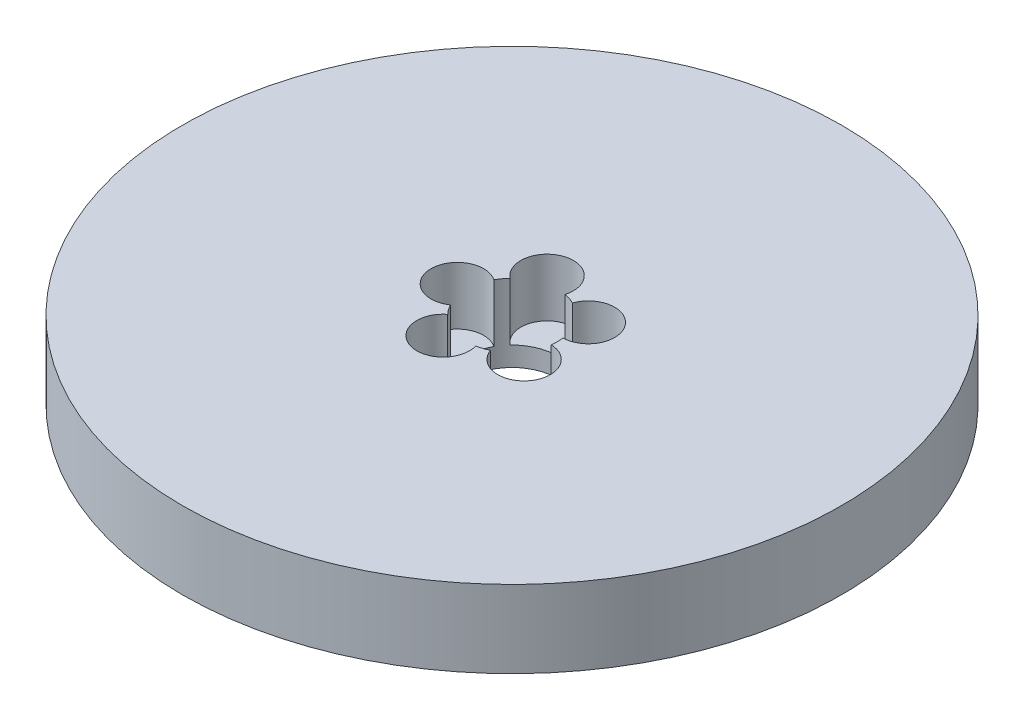
ISO-10303-21;
HEADER;
FILE_DESCRIPTION(('STEP AP214'),'2;1');
FILE_NAME('part.step','',(''),(''),'','','');
FILE_SCHEMA(('AUTOMOTIVE_DESIGN { 1 0 10303 214 1 1 1 1 }'));
ENDSEC;
DATA;
#1=APPLICATION_CONTEXT('core data for automotive mechanical design processes');
#2=APPLICATION_PROTOCOL_DEFINITION('international standard','automotive_design',2000,#1);
#3=PRODUCT_CONTEXT('',#1,'mechanical');
#4=PRODUCT('Part','Part','',(#3));
#5=PRODUCT_RELATED_PRODUCT_CATEGORY('part','',(#4));
#6=PRODUCT_DEFINITION_FORMATION('','',#4);
#7=PRODUCT_DEFINITION_CONTEXT('part definition',#1,'design');
#8=PRODUCT_DEFINITION('design','',#6,#7);
#9=PRODUCT_DEFINITION_SHAPE('','',#8);
#10=(LENGTH_UNIT() NAMED_UNIT(*) SI_UNIT(.MILLI.,.METRE.));
#11=(NAMED_UNIT(*) PLANE_ANGLE_UNIT() SI_UNIT($,.RADIAN.));
#12=(NAMED_UNIT(*) SI_UNIT($,.STERADIAN.) SOLID_ANGLE_UNIT());
#13=UNCERTAINTY_MEASURE_WITH_UNIT(LENGTH_MEASURE(1.E-05),#10,'distance_accuracy_value','');
#14=(GEOMETRIC_REPRESENTATION_CONTEXT(3) GLOBAL_UNCERTAINTY_ASSIGNED_CONTEXT((#13)) GLOBAL_UNIT_ASSIGNED_CONTEXT((#10,
#11,#12)) REPRESENTATION_CONTEXT('',''));
#15=CARTESIAN_POINT('',(0.,0.,0.));
#16=DIRECTION('',(0.,0.,1.));
#17=DIRECTION('',(1.,0.,0.));
#18=AXIS2_PLACEMENT_3D('',#15,#16,#17);
#19=CARTESIAN_POINT('',(0.,17.,0.));
#20=DIRECTION('',(0.,-1.,0.));
#21=DIRECTION('',(0.,0.,-1.));
#22=AXIS2_PLACEMENT_3D('',#19,#20,#21);
#23=CYLINDRICAL_SURFACE('',#22,72.5);
#24=CARTESIAN_POINT('',(0.,17.,0.));
#25=DIRECTION('',(0.,1.,0.));
#26=DIRECTION('',(0.,0.,1.));
#27=AXIS2_PLACEMENT_3D('',#24,#25,#26);
#28=CIRCLE('',#27,72.5);
#29=CARTESIAN_POINT('',(0.,17.,72.5));
#30=VERTEX_POINT('',#29);
#31=EDGE_CURVE('E157',#30,#30,#28,.T.);
#32=ORIENTED_EDGE('',*,*,#31,.F.);
#33=EDGE_LOOP('',(#32));
#34=FACE_BOUND('',#33,.T.);
#35=CARTESIAN_POINT('',(0.,0.,0.));
#36=DIRECTION('',(0.,1.,0.));
#37=DIRECTION('',(0.,0.,1.));
#38=AXIS2_PLACEMENT_3D('',#35,#36,#37);
#39=CIRCLE('',#38,72.5);
#40=CARTESIAN_POINT('',(0.,0.,72.5));
#41=VERTEX_POINT('',#40);
#42=EDGE_CURVE('E150',#41,#41,#39,.T.);
#43=ORIENTED_EDGE('',*,*,#42,.T.);
#44=EDGE_LOOP('',(#43));
#45=FACE_BOUND('',#44,.T.);
#46=ADVANCED_FACE('F39',(#34,#45),#23,.T.);
#47=CARTESIAN_POINT('',(0.,17.,0.));
#48=DIRECTION('',(0.,1.,0.));
#49=DIRECTION('',(0.,0.,1.));
#50=AXIS2_PLACEMENT_3D('',#47,#48,#49);
#51=PLANE('',#50);
#52=CARTESIAN_POINT('',(-3.71574455172033,17.,-11.4358858351779));
#53=DIRECTION('',(0.,1.,0.));
#54=DIRECTION('',(-0.95105651629515,0.,0.309016994374958));
#55=AXIS2_PLACEMENT_3D('',#52,#53,#54);
#56=CIRCLE('',#55,5.78738349400085);
#57=CARTESIAN_POINT('',(1.84394883160901,17.,-9.82852240707665));
#58=VERTEX_POINT('',#57);
#59=CARTESIAN_POINT('',(-7.26884646423545,17.,-6.86759572771809));
#60=VERTEX_POINT('',#59);
#61=EDGE_CURVE('E194',#58,#60,#56,.T.);
#62=ORIENTED_EDGE('',*,*,#61,.F.);
#63=CARTESIAN_POINT('',(0.,17.,0.));
#64=DIRECTION('',(0.,1.,0.));
#65=DIRECTION('',(0.,0.,1.));
#66=AXIS2_PLACEMENT_3D('',#63,#64,#65);
#67=CIRCLE('',#66,10.);
#68=CARTESIAN_POINT('',(4.28527458117607,17.,-9.03528758612178));
#69=VERTEX_POINT('',#68);
#70=EDGE_CURVE('E147',#69,#58,#67,.T.);
#71=ORIENTED_EDGE('',*,*,#70,.F.);
#72=CARTESIAN_POINT('',(9.72794552991567,17.,-7.06776613760351));
#73=DIRECTION('',(0.,1.,0.));
#74=DIRECTION('',(-0.58778525229248,0.,-0.809016994374942));
#75=AXIS2_PLACEMENT_3D('',#72,#73,#74);
#76=CIRCLE('',#75,5.78738349400085);
#77=CARTESIAN_POINT('',(9.91729180652819,17.,-1.28348090136504));
#78=VERTEX_POINT('',#77);
#79=EDGE_CURVE('E254',#78,#69,#76,.T.);
#80=ORIENTED_EDGE('',*,*,#79,.F.);
#81=CARTESIAN_POINT('',(9.91729180652821,17.,1.28348090136489));
#82=VERTEX_POINT('',#81);
#83=EDGE_CURVE('E144',#82,#78,#67,.T.);
#84=ORIENTED_EDGE('',*,*,#83,.F.);
#85=CARTESIAN_POINT('',(9.72794552991578,17.,7.06776613760337));
#86=DIRECTION('',(0.,1.,0.));
#87=DIRECTION('',(0.587785252292469,0.,-0.809016994374951));
#88=AXIS2_PLACEMENT_3D('',#85,#86,#87);
#89=CIRCLE('',#88,5.78738349400085);
#90=CARTESIAN_POINT('',(4.2852745811762,17.,9.03528758612171));
#91=VERTEX_POINT('',#90);
#92=EDGE_CURVE('E141',#91,#82,#89,.T.);
#93=ORIENTED_EDGE('',*,*,#92,.F.);
#94=CARTESIAN_POINT('',(1.84394883160915,17.,9.82852240707662));
#95=VERTEX_POINT('',#94);
#96=EDGE_CURVE('E134',#95,#91,#67,.T.);
#97=ORIENTED_EDGE('',*,*,#96,.F.);
#98=CARTESIAN_POINT('',(-3.71574455172017,17.,11.4358858351779));
#99=DIRECTION('',(0.,1.,0.));
#100=DIRECTION('',(0.951056516295155,0.,0.309016994374945));
#101=AXIS2_PLACEMENT_3D('',#98,#99,#100);
#102=CIRCLE('',#101,5.78738349400085);
#103=CARTESIAN_POINT('',(-7.26884646423535,17.,6.8675957277182));
#104=VERTEX_POINT('',#103);
#105=EDGE_CURVE('E111',#104,#95,#102,.T.);
#106=ORIENTED_EDGE('',*,*,#105,.F.);
#107=CARTESIAN_POINT('',(-8.77766875507811,17.,4.79088000539834));
#108=VERTEX_POINT('',#107);
#109=EDGE_CURVE('E145',#108,#104,#67,.T.);
#110=ORIENTED_EDGE('',*,*,#109,.F.);
#111=CARTESIAN_POINT('',(-12.0244019563911,17.,0.));
#112=DIRECTION('',(0.,1.,0.));
#113=DIRECTION('',(0.,0.,1.));
#114=AXIS2_PLACEMENT_3D('',#111,#112,#113);
#115=CIRCLE('',#114,5.78738349400085);
#116=CARTESIAN_POINT('',(-8.77766875507811,17.,-4.79088000539834));
#117=VERTEX_POINT('',#116);
#118=EDGE_CURVE('E153',#117,#108,#115,.T.);
#119=ORIENTED_EDGE('',*,*,#118,.F.);
#120=EDGE_CURVE('E146',#60,#117,#67,.T.);
#121=ORIENTED_EDGE('',*,*,#120,.F.);
#122=EDGE_LOOP('',(#62,#71,#80,#84,#93,#97,#106,#110,#119,#121));
#123=FACE_BOUND('',#122,.T.);
#124=ORIENTED_EDGE('',*,*,#31,.T.);
#125=EDGE_LOOP('',(#124));
#126=FACE_BOUND('',#125,.T.);
#127=ADVANCED_FACE('F139',(#123,#126),#51,.T.);
#128=CARTESIAN_POINT('',(0.,0.,0.));
#129=DIRECTION('',(0.,1.,0.));
#130=DIRECTION('',(0.,0.,1.));
#131=AXIS2_PLACEMENT_3D('',#128,#129,#130);
#132=PLANE('',#131);
#133=CARTESIAN_POINT('',(0.,0.,0.));
#134=DIRECTION('',(0.,1.,0.));
#135=DIRECTION('',(0.,0.,1.));
#136=AXIS2_PLACEMENT_3D('',#133,#134,#135);
#137=CIRCLE('',#136,10.);
#138=CARTESIAN_POINT('',(0.,0.,10.));
#139=VERTEX_POINT('',#138);
#140=EDGE_CURVE('E154',#139,#139,#137,.T.);
#141=ORIENTED_EDGE('',*,*,#140,.T.);
#142=EDGE_LOOP('',(#141));
#143=FACE_BOUND('',#142,.T.);
#144=ORIENTED_EDGE('',*,*,#42,.F.);
#145=EDGE_LOOP('',(#144));
#146=FACE_BOUND('',#145,.T.);
#147=ADVANCED_FACE('F213',(#143,#146),#132,.F.);
#148=CARTESIAN_POINT('',(0.,17.,0.));
#149=DIRECTION('',(0.,-1.,0.));
#150=DIRECTION('',(0.,0.,-1.));
#151=AXIS2_PLACEMENT_3D('',#148,#149,#150);
#152=CYLINDRICAL_SURFACE('',#151,10.);
#153=DIRECTION('',(0.,1.,0.));
#154=VECTOR('',#153,1.);
#155=CARTESIAN_POINT('',(1.84394883160901,10.6433004450835,-9.82852240707665));
#156=LINE('',#155,#154);
#157=CARTESIAN_POINT('',(1.84394883160901,4.28660089016696,-9.82852240707665));
#158=VERTEX_POINT('',#157);
#159=EDGE_CURVE('E11',#158,#58,#156,.T.);
#160=ORIENTED_EDGE('',*,*,#159,.F.);
#161=CARTESIAN_POINT('',(0.,4.28660089016696,0.));
#162=DIRECTION('',(0.,1.,0.));
#163=DIRECTION('',(0.,0.,1.));
#164=AXIS2_PLACEMENT_3D('',#161,#162,#163);
#165=CIRCLE('',#164,10.);
#166=CARTESIAN_POINT('',(-7.26884646423545,4.28660089016696,-6.86759572771809));
#167=VERTEX_POINT('',#166);
#168=EDGE_CURVE('E189',#158,#167,#165,.T.);
#169=ORIENTED_EDGE('',*,*,#168,.T.);
#170=DIRECTION('',(0.,1.,0.));
#171=VECTOR('',#170,1.);
#172=CARTESIAN_POINT('',(-7.26884646423545,10.6433004450835,-6.86759572771809));
#173=LINE('',#172,#171);
#174=EDGE_CURVE('E46',#60,#167,#173,.F.);
#175=ORIENTED_EDGE('',*,*,#174,.F.);
#176=ORIENTED_EDGE('',*,*,#120,.T.);
#177=DIRECTION('',(0.,1.,0.));
#178=VECTOR('',#177,1.);
#179=CARTESIAN_POINT('',(-8.77766875507811,10.6433004450835,-4.79088000539834));
#180=LINE('',#179,#178);
#181=CARTESIAN_POINT('',(-8.77766875507811,4.28660089016696,-4.79088000539834));
#182=VERTEX_POINT('',#181);
#183=EDGE_CURVE('E168',#182,#117,#180,.T.);
#184=ORIENTED_EDGE('',*,*,#183,.F.);
#185=CARTESIAN_POINT('',(0.,4.28660089016696,0.));
#186=DIRECTION('',(0.,1.,0.));
#187=DIRECTION('',(0.,0.,1.));
#188=AXIS2_PLACEMENT_3D('',#185,#186,#187);
#189=CIRCLE('',#188,10.);
#190=CARTESIAN_POINT('',(-8.77766875507811,4.28660089016696,4.79088000539834));
#191=VERTEX_POINT('',#190);
#192=EDGE_CURVE('E165',#182,#191,#189,.T.);
#193=ORIENTED_EDGE('',*,*,#192,.T.);
#194=DIRECTION('',(0.,1.,0.));
#195=VECTOR('',#194,1.);
#196=CARTESIAN_POINT('',(-8.77766875507811,10.6433004450835,4.79088000539834));
#197=LINE('',#196,#195);
#198=EDGE_CURVE('E170',#108,#191,#197,.F.);
#199=ORIENTED_EDGE('',*,*,#198,.F.);
#200=ORIENTED_EDGE('',*,*,#109,.T.);
#201=DIRECTION('',(0.,1.,0.));
#202=VECTOR('',#201,1.);
#203=CARTESIAN_POINT('',(-7.26884646423535,10.6433004450835,6.8675957277182));
#204=LINE('',#203,#202);
#205=CARTESIAN_POINT('',(-7.26884646423535,4.28660089016696,6.8675957277182));
#206=VERTEX_POINT('',#205);
#207=EDGE_CURVE('E121',#206,#104,#204,.T.);
#208=ORIENTED_EDGE('',*,*,#207,.F.);
#209=CARTESIAN_POINT('',(0.,4.28660089016696,0.));
#210=DIRECTION('',(0.,1.,0.));
#211=DIRECTION('',(0.,0.,1.));
#212=AXIS2_PLACEMENT_3D('',#209,#210,#211);
#213=CIRCLE('',#212,10.);
#214=CARTESIAN_POINT('',(1.84394883160915,4.28660089016696,9.82852240707662));
#215=VERTEX_POINT('',#214);
#216=EDGE_CURVE('E136',#206,#215,#213,.T.);
#217=ORIENTED_EDGE('',*,*,#216,.T.);
#218=DIRECTION('',(0.,1.,0.));
#219=VECTOR('',#218,1.);
#220=CARTESIAN_POINT('',(1.84394883160915,10.6433004450835,9.82852240707662));
#221=LINE('',#220,#219);
#222=EDGE_CURVE('E117',#95,#215,#221,.F.);
#223=ORIENTED_EDGE('',*,*,#222,.F.);
#224=ORIENTED_EDGE('',*,*,#96,.T.);
#225=DIRECTION('',(0.,1.,0.));
#226=VECTOR('',#225,1.);
#227=CARTESIAN_POINT('',(4.2852745811762,10.6433004450835,9.03528758612171));
#228=LINE('',#227,#226);
#229=CARTESIAN_POINT('',(4.2852745811762,4.28660089016696,9.03528758612171));
#230=VERTEX_POINT('',#229);
#231=EDGE_CURVE('E182',#230,#91,#228,.T.);
#232=ORIENTED_EDGE('',*,*,#231,.F.);
#233=CARTESIAN_POINT('',(0.,4.28660089016696,0.));
#234=DIRECTION('',(0.,1.,0.));
#235=DIRECTION('',(0.,0.,1.));
#236=AXIS2_PLACEMENT_3D('',#233,#234,#235);
#237=CIRCLE('',#236,10.);
#238=CARTESIAN_POINT('',(9.91729180652821,4.28660089016696,1.28348090136489));
#239=VERTEX_POINT('',#238);
#240=EDGE_CURVE('E174',#230,#239,#237,.T.);
#241=ORIENTED_EDGE('',*,*,#240,.T.);
#242=DIRECTION('',(0.,1.,0.));
#243=VECTOR('',#242,1.);
#244=CARTESIAN_POINT('',(9.91729180652821,10.6433004450835,1.28348090136489));
#245=LINE('',#244,#243);
#246=EDGE_CURVE('E177',#82,#239,#245,.F.);
#247=ORIENTED_EDGE('',*,*,#246,.F.);
#248=ORIENTED_EDGE('',*,*,#83,.T.);
#249=DIRECTION('',(0.,1.,0.));
#250=VECTOR('',#249,1.);
#251=CARTESIAN_POINT('',(9.91729180652819,10.6433004450835,-1.28348090136504));
#252=LINE('',#251,#250);
#253=CARTESIAN_POINT('',(9.91729180652819,4.28660089016696,-1.28348090136504));
#254=VERTEX_POINT('',#253);
#255=EDGE_CURVE('E187',#254,#78,#252,.T.);
#256=ORIENTED_EDGE('',*,*,#255,.F.);
#257=CARTESIAN_POINT('',(0.,4.28660089016696,0.));
#258=DIRECTION('',(0.,1.,0.));
#259=DIRECTION('',(0.,0.,1.));
#260=AXIS2_PLACEMENT_3D('',#257,#258,#259);
#261=CIRCLE('',#260,10.);
#262=CARTESIAN_POINT('',(4.28527458117607,4.28660089016696,-9.03528758612178));
#263=VERTEX_POINT('',#262);
#264=EDGE_CURVE('E181',#254,#263,#261,.T.);
#265=ORIENTED_EDGE('',*,*,#264,.T.);
#266=DIRECTION('',(0.,1.,0.));
#267=VECTOR('',#266,1.);
#268=CARTESIAN_POINT('',(4.28527458117607,10.6433004450835,-9.03528758612178));
#269=LINE('',#268,#267);
#270=EDGE_CURVE('E186',#69,#263,#269,.F.);
#271=ORIENTED_EDGE('',*,*,#270,.F.);
#272=ORIENTED_EDGE('',*,*,#70,.T.);
#273=EDGE_LOOP('',(#160,#169,#175,#176,#184,#193,#199,#200,#208,#217,#223,#224,#232,#241,#247,
#248,#256,#265,#271,#272));
#274=FACE_BOUND('',#273,.T.);
#275=ORIENTED_EDGE('',*,*,#140,.F.);
#276=EDGE_LOOP('',(#275));
#277=FACE_BOUND('',#276,.T.);
#278=ADVANCED_FACE('F135',(#274,#277),#152,.F.);
#279=CARTESIAN_POINT('',(-12.0244019563911,4.28660089016696,0.));
#280=DIRECTION('',(0.,1.,0.));
#281=DIRECTION('',(0.,0.,1.));
#282=AXIS2_PLACEMENT_3D('',#279,#280,#281);
#283=CYLINDRICAL_SURFACE('',#282,5.78738349400085);
#284=ORIENTED_EDGE('',*,*,#183,.T.);
#285=ORIENTED_EDGE('',*,*,#118,.T.);
#286=ORIENTED_EDGE('',*,*,#198,.T.);
#287=CARTESIAN_POINT('',(-12.0244019563911,4.28660089016696,0.));
#288=DIRECTION('',(0.,1.,0.));
#289=DIRECTION('',(0.,0.,1.));
#290=AXIS2_PLACEMENT_3D('',#287,#288,#289);
#291=CIRCLE('',#290,5.78738349400085);
#292=EDGE_CURVE('E158',#182,#191,#291,.T.);
#293=ORIENTED_EDGE('',*,*,#292,.F.);
#294=EDGE_LOOP('',(#284,#285,#286,#293));
#295=FACE_BOUND('',#294,.T.);
#296=ADVANCED_FACE('F221',(#295),#283,.F.);
#297=CARTESIAN_POINT('',(-12.0244019563911,4.28660089016696,0.));
#298=DIRECTION('',(0.,1.,0.));
#299=DIRECTION('',(0.,0.,1.));
#300=AXIS2_PLACEMENT_3D('',#297,#298,#299);
#301=PLANE('',#300);
#302=ORIENTED_EDGE('',*,*,#292,.T.);
#303=ORIENTED_EDGE('',*,*,#192,.F.);
#304=EDGE_LOOP('',(#302,#303));
#305=FACE_BOUND('',#304,.T.);
#306=ADVANCED_FACE('F227',(#305),#301,.T.);
#307=CARTESIAN_POINT('',(-3.71574455172017,4.28660089016696,11.4358858351779));
#308=DIRECTION('',(0.,1.,0.));
#309=DIRECTION('',(0.,0.,1.));
#310=AXIS2_PLACEMENT_3D('',#307,#308,#309);
#311=CYLINDRICAL_SURFACE('',#310,5.78738349400085);
#312=ORIENTED_EDGE('',*,*,#207,.T.);
#313=ORIENTED_EDGE('',*,*,#105,.T.);
#314=ORIENTED_EDGE('',*,*,#222,.T.);
#315=CARTESIAN_POINT('',(-3.71574455172017,4.28660089016696,11.4358858351779));
#316=DIRECTION('',(0.,1.,0.));
#317=DIRECTION('',(0.951056516295155,0.,0.309016994374945));
#318=AXIS2_PLACEMENT_3D('',#315,#316,#317);
#319=CIRCLE('',#318,5.78738349400085);
#320=EDGE_CURVE('E127',#206,#215,#319,.T.);
#321=ORIENTED_EDGE('',*,*,#320,.F.);
#322=EDGE_LOOP('',(#312,#313,#314,#321));
#323=FACE_BOUND('',#322,.T.);
#324=ADVANCED_FACE('F116',(#323),#311,.F.);
#325=CARTESIAN_POINT('',(-3.71574455172017,4.28660089016696,11.4358858351779));
#326=DIRECTION('',(0.,1.,0.));
#327=DIRECTION('',(0.951056516295155,0.,0.309016994374945));
#328=AXIS2_PLACEMENT_3D('',#325,#326,#327);
#329=PLANE('',#328);
#330=ORIENTED_EDGE('',*,*,#320,.T.);
#331=ORIENTED_EDGE('',*,*,#216,.F.);
#332=EDGE_LOOP('',(#330,#331));
#333=FACE_BOUND('',#332,.T.);
#334=ADVANCED_FACE('F234',(#333),#329,.T.);
#335=CARTESIAN_POINT('',(9.72794552991578,4.28660089016696,7.06776613760337));
#336=DIRECTION('',(0.,1.,0.));
#337=DIRECTION('',(0.,0.,1.));
#338=AXIS2_PLACEMENT_3D('',#335,#336,#337);
#339=CYLINDRICAL_SURFACE('',#338,5.78738349400085);
#340=ORIENTED_EDGE('',*,*,#231,.T.);
#341=ORIENTED_EDGE('',*,*,#92,.T.);
#342=ORIENTED_EDGE('',*,*,#246,.T.);
#343=CARTESIAN_POINT('',(9.72794552991578,4.28660089016696,7.06776613760337));
#344=DIRECTION('',(0.,1.,0.));
#345=DIRECTION('',(0.587785252292469,0.,-0.809016994374951));
#346=AXIS2_PLACEMENT_3D('',#343,#344,#345);
#347=CIRCLE('',#346,5.78738349400085);
#348=EDGE_CURVE('E130',#230,#239,#347,.T.);
#349=ORIENTED_EDGE('',*,*,#348,.F.);
#350=EDGE_LOOP('',(#340,#341,#342,#349));
#351=FACE_BOUND('',#350,.T.);
#352=ADVANCED_FACE('F240',(#351),#339,.F.);
#353=CARTESIAN_POINT('',(9.72794552991578,4.28660089016696,7.06776613760337));
#354=DIRECTION('',(0.,1.,0.));
#355=DIRECTION('',(0.587785252292469,0.,-0.809016994374951));
#356=AXIS2_PLACEMENT_3D('',#353,#354,#355);
#357=PLANE('',#356);
#358=ORIENTED_EDGE('',*,*,#348,.T.);
#359=ORIENTED_EDGE('',*,*,#240,.F.);
#360=EDGE_LOOP('',(#358,#359));
#361=FACE_BOUND('',#360,.T.);
#362=ADVANCED_FACE('F245',(#361),#357,.T.);
#363=CARTESIAN_POINT('',(9.72794552991567,4.28660089016696,-7.06776613760351));
#364=DIRECTION('',(0.,1.,0.));
#365=DIRECTION('',(0.,0.,1.));
#366=AXIS2_PLACEMENT_3D('',#363,#364,#365);
#367=CYLINDRICAL_SURFACE('',#366,5.78738349400085);
#368=ORIENTED_EDGE('',*,*,#255,.T.);
#369=ORIENTED_EDGE('',*,*,#79,.T.);
#370=ORIENTED_EDGE('',*,*,#270,.T.);
#371=CARTESIAN_POINT('',(9.72794552991567,4.28660089016696,-7.06776613760351));
#372=DIRECTION('',(0.,1.,0.));
#373=DIRECTION('',(-0.58778525229248,0.,-0.809016994374942));
#374=AXIS2_PLACEMENT_3D('',#371,#372,#373);
#375=CIRCLE('',#374,5.78738349400085);
#376=EDGE_CURVE('E56',#254,#263,#375,.T.);
#377=ORIENTED_EDGE('',*,*,#376,.F.);
#378=EDGE_LOOP('',(#368,#369,#370,#377));
#379=FACE_BOUND('',#378,.T.);
#380=ADVANCED_FACE('F266',(#379),#367,.F.);
#381=CARTESIAN_POINT('',(9.72794552991567,4.28660089016696,-7.06776613760351));
#382=DIRECTION('',(0.,1.,0.));
#383=DIRECTION('',(-0.58778525229248,0.,-0.809016994374942));
#384=AXIS2_PLACEMENT_3D('',#381,#382,#383);
#385=PLANE('',#384);
#386=ORIENTED_EDGE('',*,*,#376,.T.);
#387=ORIENTED_EDGE('',*,*,#264,.F.);
#388=EDGE_LOOP('',(#386,#387));
#389=FACE_BOUND('',#388,.T.);
#390=ADVANCED_FACE('F204',(#389),#385,.T.);
#391=CARTESIAN_POINT('',(-3.71574455172033,4.28660089016696,-11.4358858351779));
#392=DIRECTION('',(0.,1.,0.));
#393=DIRECTION('',(0.,0.,1.));
#394=AXIS2_PLACEMENT_3D('',#391,#392,#393);
#395=CYLINDRICAL_SURFACE('',#394,5.78738349400085);
#396=ORIENTED_EDGE('',*,*,#159,.T.);
#397=ORIENTED_EDGE('',*,*,#61,.T.);
#398=ORIENTED_EDGE('',*,*,#174,.T.);
#399=CARTESIAN_POINT('',(-3.71574455172033,4.28660089016696,-11.4358858351779));
#400=DIRECTION('',(0.,1.,0.));
#401=DIRECTION('',(-0.95105651629515,0.,0.309016994374958));
#402=AXIS2_PLACEMENT_3D('',#399,#400,#401);
#403=CIRCLE('',#402,5.78738349400085);
#404=EDGE_CURVE('E55',#158,#167,#403,.T.);
#405=ORIENTED_EDGE('',*,*,#404,.F.);
#406=EDGE_LOOP('',(#396,#397,#398,#405));
#407=FACE_BOUND('',#406,.T.);
#408=ADVANCED_FACE('F193',(#407),#395,.F.);
#409=CARTESIAN_POINT('',(-3.71574455172033,4.28660089016696,-11.4358858351779));
#410=DIRECTION('',(0.,1.,0.));
#411=DIRECTION('',(-0.95105651629515,0.,0.309016994374958));
#412=AXIS2_PLACEMENT_3D('',#409,#410,#411);
#413=PLANE('',#412);
#414=ORIENTED_EDGE('',*,*,#404,.T.);
#415=ORIENTED_EDGE('',*,*,#168,.F.);
#416=EDGE_LOOP('',(#414,#415));
#417=FACE_BOUND('',#416,.T.);
#418=ADVANCED_FACE('F196',(#417),#413,.T.);
#419=CLOSED_SHELL('',(#46,#127,#147,#278,#296,#306,#324,#334,#352,#362,#380,#390,#408,#418));
#420=MANIFOLD_SOLID_BREP('B2',#419);
#421=ADVANCED_BREP_SHAPE_REPRESENTATION('',(#18,#420),#14);
#422=SHAPE_DEFINITION_REPRESENTATION(#9,#421);
ENDSEC;
END-ISO-10303-21;
